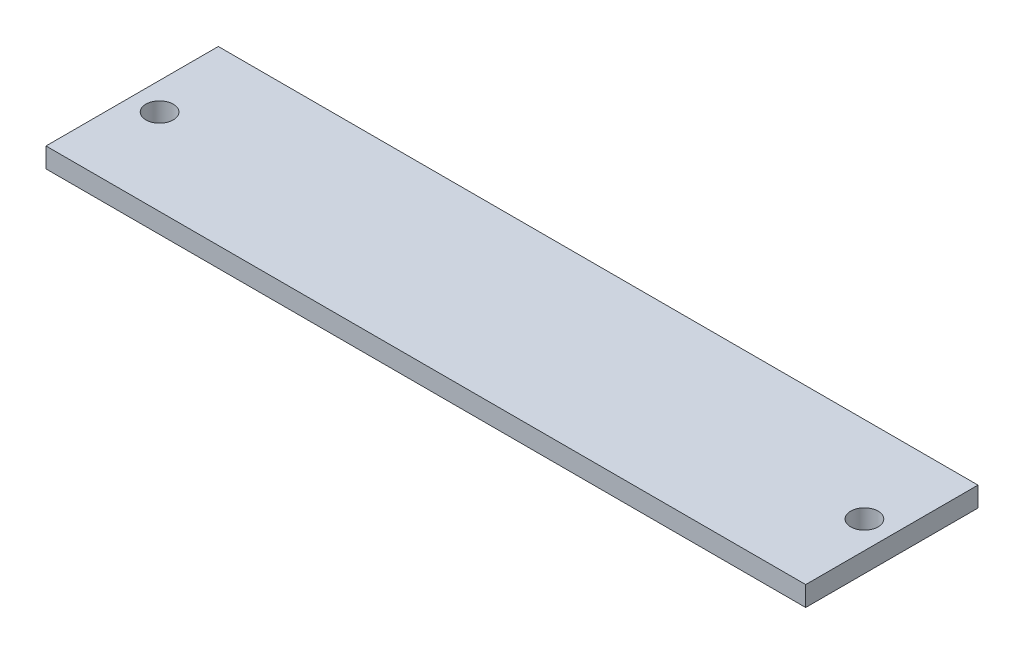
ISO-10303-21;
HEADER;
FILE_DESCRIPTION(('STEP AP214'),'2;1');
FILE_NAME('part.step','',(''),(''),'','','');
FILE_SCHEMA(('AUTOMOTIVE_DESIGN { 1 0 10303 214 1 1 1 1 }'));
ENDSEC;
DATA;
#1=APPLICATION_CONTEXT('core data for automotive mechanical design processes');
#2=APPLICATION_PROTOCOL_DEFINITION('international standard','automotive_design',2000,#1);
#3=PRODUCT_CONTEXT('',#1,'mechanical');
#4=PRODUCT('Part','Part','',(#3));
#5=PRODUCT_RELATED_PRODUCT_CATEGORY('part','',(#4));
#6=PRODUCT_DEFINITION_FORMATION('','',#4);
#7=PRODUCT_DEFINITION_CONTEXT('part definition',#1,'design');
#8=PRODUCT_DEFINITION('design','',#6,#7);
#9=PRODUCT_DEFINITION_SHAPE('','',#8);
#10=(LENGTH_UNIT() NAMED_UNIT(*) SI_UNIT(.MILLI.,.METRE.));
#11=(NAMED_UNIT(*) PLANE_ANGLE_UNIT() SI_UNIT($,.RADIAN.));
#12=(NAMED_UNIT(*) SI_UNIT($,.STERADIAN.) SOLID_ANGLE_UNIT());
#13=UNCERTAINTY_MEASURE_WITH_UNIT(LENGTH_MEASURE(1.E-05),#10,'distance_accuracy_value','');
#14=(GEOMETRIC_REPRESENTATION_CONTEXT(3) GLOBAL_UNCERTAINTY_ASSIGNED_CONTEXT((#13)) GLOBAL_UNIT_ASSIGNED_CONTEXT((#10,
#11,#12)) REPRESENTATION_CONTEXT('',''));
#15=CARTESIAN_POINT('',(0.,0.,0.));
#16=DIRECTION('',(0.,0.,1.));
#17=DIRECTION('',(1.,0.,0.));
#18=AXIS2_PLACEMENT_3D('',#15,#16,#17);
#19=CARTESIAN_POINT('',(0.,2.54,0.));
#20=DIRECTION('',(0.,-1.,0.));
#21=DIRECTION('',(0.,0.,-1.));
#22=AXIS2_PLACEMENT_3D('',#19,#20,#21);
#23=PLANE('',#22);
#24=DIRECTION('',(0.,0.,-1.));
#25=VECTOR('',#24,1.);
#26=CARTESIAN_POINT('',(48.5,2.54,11.));
#27=LINE('',#26,#25);
#28=CARTESIAN_POINT('',(48.5,2.54,11.));
#29=VERTEX_POINT('',#28);
#30=CARTESIAN_POINT('',(48.5,2.54,-11.));
#31=VERTEX_POINT('',#30);
#32=EDGE_CURVE('E104',#29,#31,#27,.T.);
#33=ORIENTED_EDGE('',*,*,#32,.T.);
#34=DIRECTION('',(-1.,0.,0.));
#35=VECTOR('',#34,1.);
#36=CARTESIAN_POINT('',(-48.5,2.54,-11.));
#37=LINE('',#36,#35);
#38=CARTESIAN_POINT('',(-48.5,2.54,-11.));
#39=VERTEX_POINT('',#38);
#40=EDGE_CURVE('E99',#31,#39,#37,.T.);
#41=ORIENTED_EDGE('',*,*,#40,.T.);
#42=DIRECTION('',(0.,0.,1.));
#43=VECTOR('',#42,1.);
#44=CARTESIAN_POINT('',(-48.5,2.54,11.));
#45=LINE('',#44,#43);
#46=CARTESIAN_POINT('',(-48.5,2.54,11.));
#47=VERTEX_POINT('',#46);
#48=EDGE_CURVE('E102',#39,#47,#45,.T.);
#49=ORIENTED_EDGE('',*,*,#48,.T.);
#50=DIRECTION('',(1.,0.,0.));
#51=VECTOR('',#50,1.);
#52=CARTESIAN_POINT('',(-48.5,2.54,11.));
#53=LINE('',#52,#51);
#54=EDGE_CURVE('E69',#47,#29,#53,.T.);
#55=ORIENTED_EDGE('',*,*,#54,.T.);
#56=EDGE_LOOP('',(#33,#41,#49,#55));
#57=FACE_BOUND('',#56,.T.);
#58=CARTESIAN_POINT('',(45.,2.54,0.));
#59=DIRECTION('',(0.,1.,0.));
#60=DIRECTION('',(0.,0.,1.));
#61=AXIS2_PLACEMENT_3D('',#58,#59,#60);
#62=CIRCLE('',#61,1.75);
#63=CARTESIAN_POINT('',(45.,2.54,1.75));
#64=VERTEX_POINT('',#63);
#65=EDGE_CURVE('E124',#64,#64,#62,.T.);
#66=ORIENTED_EDGE('',*,*,#65,.F.);
#67=EDGE_LOOP('',(#66));
#68=FACE_BOUND('',#67,.T.);
#69=CARTESIAN_POINT('',(-45.,2.54,0.));
#70=DIRECTION('',(0.,1.,0.));
#71=DIRECTION('',(0.,0.,-1.));
#72=AXIS2_PLACEMENT_3D('',#69,#70,#71);
#73=CIRCLE('',#72,1.75);
#74=CARTESIAN_POINT('',(-45.,2.54,-1.75));
#75=VERTEX_POINT('',#74);
#76=EDGE_CURVE('E146',#75,#75,#73,.T.);
#77=ORIENTED_EDGE('',*,*,#76,.F.);
#78=EDGE_LOOP('',(#77));
#79=FACE_BOUND('',#78,.T.);
#80=ADVANCED_FACE('F51',(#57,#68,#79),#23,.F.);
#81=CARTESIAN_POINT('',(0.,0.,0.));
#82=DIRECTION('',(0.,-1.,0.));
#83=DIRECTION('',(0.,0.,-1.));
#84=AXIS2_PLACEMENT_3D('',#81,#82,#83);
#85=PLANE('',#84);
#86=CARTESIAN_POINT('',(45.,0.,0.));
#87=DIRECTION('',(0.,1.,0.));
#88=DIRECTION('',(0.,0.,1.));
#89=AXIS2_PLACEMENT_3D('',#86,#87,#88);
#90=CIRCLE('',#89,1.75);
#91=CARTESIAN_POINT('',(45.,0.,1.75));
#92=VERTEX_POINT('',#91);
#93=EDGE_CURVE('E142',#92,#92,#90,.T.);
#94=ORIENTED_EDGE('',*,*,#93,.T.);
#95=EDGE_LOOP('',(#94));
#96=FACE_BOUND('',#95,.T.);
#97=DIRECTION('',(0.,0.,-1.));
#98=VECTOR('',#97,1.);
#99=CARTESIAN_POINT('',(48.5,0.,11.));
#100=LINE('',#99,#98);
#101=CARTESIAN_POINT('',(48.5,0.,11.));
#102=VERTEX_POINT('',#101);
#103=CARTESIAN_POINT('',(48.5,0.,-11.));
#104=VERTEX_POINT('',#103);
#105=EDGE_CURVE('E120',#102,#104,#100,.T.);
#106=ORIENTED_EDGE('',*,*,#105,.F.);
#107=DIRECTION('',(1.,0.,0.));
#108=VECTOR('',#107,1.);
#109=CARTESIAN_POINT('',(-48.5,0.,11.));
#110=LINE('',#109,#108);
#111=CARTESIAN_POINT('',(-48.5,0.,11.));
#112=VERTEX_POINT('',#111);
#113=EDGE_CURVE('E92',#112,#102,#110,.T.);
#114=ORIENTED_EDGE('',*,*,#113,.F.);
#115=DIRECTION('',(0.,0.,1.));
#116=VECTOR('',#115,1.);
#117=CARTESIAN_POINT('',(-48.5,0.,11.));
#118=LINE('',#117,#116);
#119=CARTESIAN_POINT('',(-48.5,0.,-11.));
#120=VERTEX_POINT('',#119);
#121=EDGE_CURVE('E86',#120,#112,#118,.T.);
#122=ORIENTED_EDGE('',*,*,#121,.F.);
#123=DIRECTION('',(-1.,0.,0.));
#124=VECTOR('',#123,1.);
#125=CARTESIAN_POINT('',(-48.5,0.,-11.));
#126=LINE('',#125,#124);
#127=EDGE_CURVE('E109',#104,#120,#126,.T.);
#128=ORIENTED_EDGE('',*,*,#127,.F.);
#129=EDGE_LOOP('',(#106,#114,#122,#128));
#130=FACE_BOUND('',#129,.T.);
#131=CARTESIAN_POINT('',(-45.,0.,0.));
#132=DIRECTION('',(0.,1.,0.));
#133=DIRECTION('',(0.,0.,-1.));
#134=AXIS2_PLACEMENT_3D('',#131,#132,#133);
#135=CIRCLE('',#134,1.75);
#136=CARTESIAN_POINT('',(-45.,0.,-1.75));
#137=VERTEX_POINT('',#136);
#138=EDGE_CURVE('E150',#137,#137,#135,.T.);
#139=ORIENTED_EDGE('',*,*,#138,.T.);
#140=EDGE_LOOP('',(#139));
#141=FACE_BOUND('',#140,.T.);
#142=ADVANCED_FACE('F137',(#96,#130,#141),#85,.T.);
#143=CARTESIAN_POINT('',(48.5,2.54,11.));
#144=DIRECTION('',(-1.,0.,0.));
#145=DIRECTION('',(0.,0.,1.));
#146=AXIS2_PLACEMENT_3D('',#143,#144,#145);
#147=PLANE('',#146);
#148=ORIENTED_EDGE('',*,*,#105,.T.);
#149=DIRECTION('',(0.,-1.,0.));
#150=VECTOR('',#149,1.);
#151=CARTESIAN_POINT('',(48.5,2.54,-11.));
#152=LINE('',#151,#150);
#153=EDGE_CURVE('E11',#31,#104,#152,.T.);
#154=ORIENTED_EDGE('',*,*,#153,.F.);
#155=ORIENTED_EDGE('',*,*,#32,.F.);
#156=DIRECTION('',(0.,-1.,0.));
#157=VECTOR('',#156,1.);
#158=CARTESIAN_POINT('',(48.5,2.54,11.));
#159=LINE('',#158,#157);
#160=EDGE_CURVE('E116',#29,#102,#159,.T.);
#161=ORIENTED_EDGE('',*,*,#160,.T.);
#162=EDGE_LOOP('',(#148,#154,#155,#161));
#163=FACE_BOUND('',#162,.T.);
#164=ADVANCED_FACE('F53',(#163),#147,.F.);
#165=CARTESIAN_POINT('',(-48.5,2.54,-11.));
#166=DIRECTION('',(0.,0.,1.));
#167=DIRECTION('',(1.,0.,0.));
#168=AXIS2_PLACEMENT_3D('',#165,#166,#167);
#169=PLANE('',#168);
#170=ORIENTED_EDGE('',*,*,#127,.T.);
#171=DIRECTION('',(0.,-1.,0.));
#172=VECTOR('',#171,1.);
#173=CARTESIAN_POINT('',(-48.5,2.54,-11.));
#174=LINE('',#173,#172);
#175=EDGE_CURVE('E61',#39,#120,#174,.T.);
#176=ORIENTED_EDGE('',*,*,#175,.F.);
#177=ORIENTED_EDGE('',*,*,#40,.F.);
#178=ORIENTED_EDGE('',*,*,#153,.T.);
#179=EDGE_LOOP('',(#170,#176,#177,#178));
#180=FACE_BOUND('',#179,.T.);
#181=ADVANCED_FACE('F108',(#180),#169,.F.);
#182=CARTESIAN_POINT('',(-48.5,2.54,11.));
#183=DIRECTION('',(1.,0.,0.));
#184=DIRECTION('',(0.,0.,-1.));
#185=AXIS2_PLACEMENT_3D('',#182,#183,#184);
#186=PLANE('',#185);
#187=ORIENTED_EDGE('',*,*,#121,.T.);
#188=DIRECTION('',(0.,-1.,0.));
#189=VECTOR('',#188,1.);
#190=CARTESIAN_POINT('',(-48.5,2.54,11.));
#191=LINE('',#190,#189);
#192=EDGE_CURVE('E111',#47,#112,#191,.T.);
#193=ORIENTED_EDGE('',*,*,#192,.F.);
#194=ORIENTED_EDGE('',*,*,#48,.F.);
#195=ORIENTED_EDGE('',*,*,#175,.T.);
#196=EDGE_LOOP('',(#187,#193,#194,#195));
#197=FACE_BOUND('',#196,.T.);
#198=ADVANCED_FACE('F112',(#197),#186,.F.);
#199=CARTESIAN_POINT('',(-48.5,2.54,11.));
#200=DIRECTION('',(0.,0.,-1.));
#201=DIRECTION('',(-1.,0.,0.));
#202=AXIS2_PLACEMENT_3D('',#199,#200,#201);
#203=PLANE('',#202);
#204=ORIENTED_EDGE('',*,*,#113,.T.);
#205=ORIENTED_EDGE('',*,*,#160,.F.);
#206=ORIENTED_EDGE('',*,*,#54,.F.);
#207=ORIENTED_EDGE('',*,*,#192,.T.);
#208=EDGE_LOOP('',(#204,#205,#206,#207));
#209=FACE_BOUND('',#208,.T.);
#210=ADVANCED_FACE('F134',(#209),#203,.F.);
#211=CARTESIAN_POINT('',(45.,2.54,0.));
#212=DIRECTION('',(0.,-1.,0.));
#213=DIRECTION('',(0.,0.,-1.));
#214=AXIS2_PLACEMENT_3D('',#211,#212,#213);
#215=CYLINDRICAL_SURFACE('',#214,1.75);
#216=ORIENTED_EDGE('',*,*,#65,.T.);
#217=EDGE_LOOP('',(#216));
#218=FACE_BOUND('',#217,.T.);
#219=ORIENTED_EDGE('',*,*,#93,.F.);
#220=EDGE_LOOP('',(#219));
#221=FACE_BOUND('',#220,.T.);
#222=ADVANCED_FACE('F169',(#218,#221),#215,.F.);
#223=CARTESIAN_POINT('',(-45.,2.54,0.));
#224=DIRECTION('',(0.,-1.,0.));
#225=DIRECTION('',(0.,0.,-1.));
#226=AXIS2_PLACEMENT_3D('',#223,#224,#225);
#227=CYLINDRICAL_SURFACE('',#226,1.75);
#228=ORIENTED_EDGE('',*,*,#76,.T.);
#229=EDGE_LOOP('',(#228));
#230=FACE_BOUND('',#229,.T.);
#231=ORIENTED_EDGE('',*,*,#138,.F.);
#232=EDGE_LOOP('',(#231));
#233=FACE_BOUND('',#232,.T.);
#234=ADVANCED_FACE('F158',(#230,#233),#227,.F.);
#235=CLOSED_SHELL('',(#80,#142,#164,#181,#198,#210,#222,#234));
#236=MANIFOLD_SOLID_BREP('B2',#235);
#237=ADVANCED_BREP_SHAPE_REPRESENTATION('',(#18,#236),#14);
#238=SHAPE_DEFINITION_REPRESENTATION(#9,#237);
ENDSEC;
END-ISO-10303-21;
